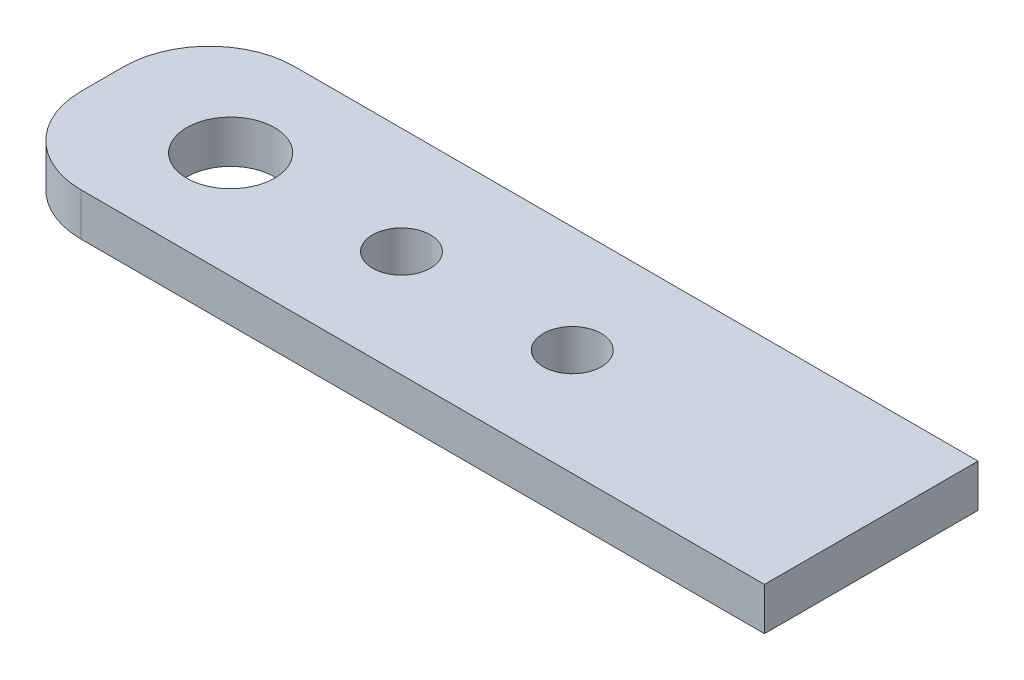
ISO-10303-21;
HEADER;
FILE_DESCRIPTION(('STEP AP214'),'2;1');
FILE_NAME('part.step','',(''),(''),'','','');
FILE_SCHEMA(('AUTOMOTIVE_DESIGN { 1 0 10303 214 1 1 1 1 }'));
ENDSEC;
DATA;
#1=APPLICATION_CONTEXT('core data for automotive mechanical design processes');
#2=APPLICATION_PROTOCOL_DEFINITION('international standard','automotive_design',2000,#1);
#3=PRODUCT_CONTEXT('',#1,'mechanical');
#4=PRODUCT('Part','Part','',(#3));
#5=PRODUCT_RELATED_PRODUCT_CATEGORY('part','',(#4));
#6=PRODUCT_DEFINITION_FORMATION('','',#4);
#7=PRODUCT_DEFINITION_CONTEXT('part definition',#1,'design');
#8=PRODUCT_DEFINITION('design','',#6,#7);
#9=PRODUCT_DEFINITION_SHAPE('','',#8);
#10=(LENGTH_UNIT() NAMED_UNIT(*) SI_UNIT(.MILLI.,.METRE.));
#11=(NAMED_UNIT(*) PLANE_ANGLE_UNIT() SI_UNIT($,.RADIAN.));
#12=(NAMED_UNIT(*) SI_UNIT($,.STERADIAN.) SOLID_ANGLE_UNIT());
#13=UNCERTAINTY_MEASURE_WITH_UNIT(LENGTH_MEASURE(1.E-05),#10,'distance_accuracy_value','');
#14=(GEOMETRIC_REPRESENTATION_CONTEXT(3) GLOBAL_UNCERTAINTY_ASSIGNED_CONTEXT((#13)) GLOBAL_UNIT_ASSIGNED_CONTEXT((#10,
#11,#12)) REPRESENTATION_CONTEXT('',''));
#15=CARTESIAN_POINT('',(0.,0.,0.));
#16=DIRECTION('',(0.,0.,1.));
#17=DIRECTION('',(1.,0.,0.));
#18=AXIS2_PLACEMENT_3D('',#15,#16,#17);
#19=CARTESIAN_POINT('',(28.575,3.175,7.9375));
#20=DIRECTION('',(-1.,0.,0.));
#21=DIRECTION('',(0.,0.,1.));
#22=AXIS2_PLACEMENT_3D('',#19,#20,#21);
#23=PLANE('',#22);
#24=DIRECTION('',(0.,0.,-1.));
#25=VECTOR('',#24,1.);
#26=CARTESIAN_POINT('',(28.575,0.,7.9375));
#27=LINE('',#26,#25);
#28=CARTESIAN_POINT('',(28.575,0.,7.9375));
#29=VERTEX_POINT('',#28);
#30=CARTESIAN_POINT('',(28.575,0.,-7.9375));
#31=VERTEX_POINT('',#30);
#32=EDGE_CURVE('E106',#29,#31,#27,.T.);
#33=ORIENTED_EDGE('',*,*,#32,.T.);
#34=DIRECTION('',(0.,-1.,0.));
#35=VECTOR('',#34,1.);
#36=CARTESIAN_POINT('',(28.575,3.175,-7.9375));
#37=LINE('',#36,#35);
#38=CARTESIAN_POINT('',(28.575,3.175,-7.9375));
#39=VERTEX_POINT('',#38);
#40=EDGE_CURVE('E91',#39,#31,#37,.T.);
#41=ORIENTED_EDGE('',*,*,#40,.F.);
#42=DIRECTION('',(0.,0.,-1.));
#43=VECTOR('',#42,1.);
#44=CARTESIAN_POINT('',(28.575,3.175,7.9375));
#45=LINE('',#44,#43);
#46=CARTESIAN_POINT('',(28.575,3.175,7.9375));
#47=VERTEX_POINT('',#46);
#48=EDGE_CURVE('E95',#47,#39,#45,.T.);
#49=ORIENTED_EDGE('',*,*,#48,.F.);
#50=DIRECTION('',(0.,-1.,0.));
#51=VECTOR('',#50,1.);
#52=CARTESIAN_POINT('',(28.575,3.175,7.9375));
#53=LINE('',#52,#51);
#54=EDGE_CURVE('E108',#47,#29,#53,.T.);
#55=ORIENTED_EDGE('',*,*,#54,.T.);
#56=EDGE_LOOP('',(#33,#41,#49,#55));
#57=FACE_BOUND('',#56,.T.);
#58=ADVANCED_FACE('F34',(#57),#23,.F.);
#59=CARTESIAN_POINT('',(-28.575,3.175,-7.9375));
#60=DIRECTION('',(0.,0.,1.));
#61=DIRECTION('',(1.,0.,0.));
#62=AXIS2_PLACEMENT_3D('',#59,#60,#61);
#63=PLANE('',#62);
#64=DIRECTION('',(-1.,0.,0.));
#65=VECTOR('',#64,1.);
#66=CARTESIAN_POINT('',(-28.575,0.,-7.9375));
#67=LINE('',#66,#65);
#68=CARTESIAN_POINT('',(-22.225,0.,-7.9375));
#69=VERTEX_POINT('',#68);
#70=EDGE_CURVE('E134',#31,#69,#67,.T.);
#71=ORIENTED_EDGE('',*,*,#70,.T.);
#72=DIRECTION('',(0.,-1.,0.));
#73=VECTOR('',#72,1.);
#74=CARTESIAN_POINT('',(-22.225,3.175,-7.9375));
#75=LINE('',#74,#73);
#76=CARTESIAN_POINT('',(-22.225,3.175,-7.9375));
#77=VERTEX_POINT('',#76);
#78=EDGE_CURVE('E57',#69,#77,#75,.F.);
#79=ORIENTED_EDGE('',*,*,#78,.T.);
#80=DIRECTION('',(-1.,0.,0.));
#81=VECTOR('',#80,1.);
#82=CARTESIAN_POINT('',(-28.575,3.175,-7.9375));
#83=LINE('',#82,#81);
#84=EDGE_CURVE('E87',#39,#77,#83,.T.);
#85=ORIENTED_EDGE('',*,*,#84,.F.);
#86=ORIENTED_EDGE('',*,*,#40,.T.);
#87=EDGE_LOOP('',(#71,#79,#85,#86));
#88=FACE_BOUND('',#87,.T.);
#89=ADVANCED_FACE('F89',(#88),#63,.F.);
#90=CARTESIAN_POINT('',(-28.575,3.175,7.9375));
#91=DIRECTION('',(1.,0.,0.));
#92=DIRECTION('',(0.,0.,-1.));
#93=AXIS2_PLACEMENT_3D('',#90,#91,#92);
#94=PLANE('',#93);
#95=DIRECTION('',(0.,0.,1.));
#96=VECTOR('',#95,1.);
#97=CARTESIAN_POINT('',(-28.575,3.175,7.9375));
#98=LINE('',#97,#96);
#99=CARTESIAN_POINT('',(-28.575,3.175,-1.5875));
#100=VERTEX_POINT('',#99);
#101=CARTESIAN_POINT('',(-28.575,3.175,1.5875));
#102=VERTEX_POINT('',#101);
#103=EDGE_CURVE('E94',#100,#102,#98,.T.);
#104=ORIENTED_EDGE('',*,*,#103,.F.);
#105=DIRECTION('',(0.,-1.,0.));
#106=VECTOR('',#105,1.);
#107=CARTESIAN_POINT('',(-28.575,3.175,-1.5875));
#108=LINE('',#107,#106);
#109=CARTESIAN_POINT('',(-28.575,0.,-1.5875));
#110=VERTEX_POINT('',#109);
#111=EDGE_CURVE('E110',#100,#110,#108,.T.);
#112=ORIENTED_EDGE('',*,*,#111,.T.);
#113=DIRECTION('',(0.,0.,1.));
#114=VECTOR('',#113,1.);
#115=CARTESIAN_POINT('',(-28.575,0.,7.9375));
#116=LINE('',#115,#114);
#117=CARTESIAN_POINT('',(-28.575,0.,1.5875));
#118=VERTEX_POINT('',#117);
#119=EDGE_CURVE('E135',#110,#118,#116,.T.);
#120=ORIENTED_EDGE('',*,*,#119,.T.);
#121=DIRECTION('',(0.,-1.,0.));
#122=VECTOR('',#121,1.);
#123=CARTESIAN_POINT('',(-28.575,3.175,1.5875));
#124=LINE('',#123,#122);
#125=EDGE_CURVE('E107',#118,#102,#124,.F.);
#126=ORIENTED_EDGE('',*,*,#125,.T.);
#127=EDGE_LOOP('',(#104,#112,#120,#126));
#128=FACE_BOUND('',#127,.T.);
#129=ADVANCED_FACE('F126',(#128),#94,.F.);
#130=CARTESIAN_POINT('',(-28.575,3.175,7.9375));
#131=DIRECTION('',(0.,0.,-1.));
#132=DIRECTION('',(-1.,0.,0.));
#133=AXIS2_PLACEMENT_3D('',#130,#131,#132);
#134=PLANE('',#133);
#135=DIRECTION('',(1.,0.,0.));
#136=VECTOR('',#135,1.);
#137=CARTESIAN_POINT('',(-28.575,3.175,7.9375));
#138=LINE('',#137,#136);
#139=CARTESIAN_POINT('',(-22.225,3.175,7.9375));
#140=VERTEX_POINT('',#139);
#141=EDGE_CURVE('E99',#140,#47,#138,.T.);
#142=ORIENTED_EDGE('',*,*,#141,.F.);
#143=DIRECTION('',(0.,-1.,0.));
#144=VECTOR('',#143,1.);
#145=CARTESIAN_POINT('',(-22.225,3.175,7.9375));
#146=LINE('',#145,#144);
#147=CARTESIAN_POINT('',(-22.225,0.,7.9375));
#148=VERTEX_POINT('',#147);
#149=EDGE_CURVE('E11',#140,#148,#146,.T.);
#150=ORIENTED_EDGE('',*,*,#149,.T.);
#151=DIRECTION('',(1.,0.,0.));
#152=VECTOR('',#151,1.);
#153=CARTESIAN_POINT('',(-28.575,0.,7.9375));
#154=LINE('',#153,#152);
#155=EDGE_CURVE('E103',#148,#29,#154,.T.);
#156=ORIENTED_EDGE('',*,*,#155,.T.);
#157=ORIENTED_EDGE('',*,*,#54,.F.);
#158=EDGE_LOOP('',(#142,#150,#156,#157));
#159=FACE_BOUND('',#158,.T.);
#160=ADVANCED_FACE('F143',(#159),#134,.F.);
#161=CARTESIAN_POINT('',(0.,3.175,0.));
#162=DIRECTION('',(0.,-1.,0.));
#163=DIRECTION('',(0.,0.,-1.));
#164=AXIS2_PLACEMENT_3D('',#161,#162,#163);
#165=PLANE('',#164);
#166=CARTESIAN_POINT('',(-6.35,3.175,0.));
#167=DIRECTION('',(0.,1.,0.));
#168=DIRECTION('',(0.,0.,1.));
#169=AXIS2_PLACEMENT_3D('',#166,#167,#168);
#170=CIRCLE('',#169,2.15265);
#171=CARTESIAN_POINT('',(-6.35,3.175,2.15265));
#172=VERTEX_POINT('',#171);
#173=EDGE_CURVE('E186',#172,#172,#170,.T.);
#174=ORIENTED_EDGE('',*,*,#173,.F.);
#175=EDGE_LOOP('',(#174));
#176=FACE_BOUND('',#175,.T.);
#177=CARTESIAN_POINT('',(6.35,3.175,0.));
#178=DIRECTION('',(0.,1.,0.));
#179=DIRECTION('',(0.,0.,1.));
#180=AXIS2_PLACEMENT_3D('',#177,#178,#179);
#181=CIRCLE('',#180,2.15265);
#182=CARTESIAN_POINT('',(6.35,3.175,2.15265));
#183=VERTEX_POINT('',#182);
#184=EDGE_CURVE('E188',#183,#183,#181,.T.);
#185=ORIENTED_EDGE('',*,*,#184,.F.);
#186=EDGE_LOOP('',(#185));
#187=FACE_BOUND('',#186,.T.);
#188=CARTESIAN_POINT('',(-19.05,3.175,0.));
#189=DIRECTION('',(0.,1.,0.));
#190=DIRECTION('',(0.,0.,1.));
#191=AXIS2_PLACEMENT_3D('',#188,#189,#190);
#192=CIRCLE('',#191,3.26389999999999);
#193=CARTESIAN_POINT('',(-19.05,3.175,3.26389999999999));
#194=VERTEX_POINT('',#193);
#195=EDGE_CURVE('E196',#194,#194,#192,.T.);
#196=ORIENTED_EDGE('',*,*,#195,.F.);
#197=EDGE_LOOP('',(#196));
#198=FACE_BOUND('',#197,.T.);
#199=ORIENTED_EDGE('',*,*,#84,.T.);
#200=CARTESIAN_POINT('',(-22.225,3.175,-1.5875));
#201=DIRECTION('',(0.,-1.,0.));
#202=DIRECTION('',(0.,0.,-1.));
#203=AXIS2_PLACEMENT_3D('',#200,#201,#202);
#204=CIRCLE('',#203,6.35);
#205=EDGE_CURVE('E42',#77,#100,#204,.F.);
#206=ORIENTED_EDGE('',*,*,#205,.T.);
#207=ORIENTED_EDGE('',*,*,#103,.T.);
#208=CARTESIAN_POINT('',(-22.225,3.175,1.5875));
#209=DIRECTION('',(0.,-1.,0.));
#210=DIRECTION('',(0.,0.,-1.));
#211=AXIS2_PLACEMENT_3D('',#208,#209,#210);
#212=CIRCLE('',#211,6.35);
#213=EDGE_CURVE('E49',#102,#140,#212,.F.);
#214=ORIENTED_EDGE('',*,*,#213,.T.);
#215=ORIENTED_EDGE('',*,*,#141,.T.);
#216=ORIENTED_EDGE('',*,*,#48,.T.);
#217=EDGE_LOOP('',(#199,#206,#207,#214,#215,#216));
#218=FACE_BOUND('',#217,.T.);
#219=ADVANCED_FACE('F98',(#176,#187,#198,#218),#165,.F.);
#220=CARTESIAN_POINT('',(0.,0.,0.));
#221=DIRECTION('',(0.,-1.,0.));
#222=DIRECTION('',(0.,0.,-1.));
#223=AXIS2_PLACEMENT_3D('',#220,#221,#222);
#224=PLANE('',#223);
#225=CARTESIAN_POINT('',(-6.35,0.,0.));
#226=DIRECTION('',(0.,1.,0.));
#227=DIRECTION('',(0.,0.,1.));
#228=AXIS2_PLACEMENT_3D('',#225,#226,#227);
#229=CIRCLE('',#228,2.15265);
#230=CARTESIAN_POINT('',(-6.35,0.,2.15265));
#231=VERTEX_POINT('',#230);
#232=EDGE_CURVE('E183',#231,#231,#229,.T.);
#233=ORIENTED_EDGE('',*,*,#232,.T.);
#234=EDGE_LOOP('',(#233));
#235=FACE_BOUND('',#234,.T.);
#236=CARTESIAN_POINT('',(6.35,0.,0.));
#237=DIRECTION('',(0.,1.,0.));
#238=DIRECTION('',(0.,0.,1.));
#239=AXIS2_PLACEMENT_3D('',#236,#237,#238);
#240=CIRCLE('',#239,2.15265);
#241=CARTESIAN_POINT('',(6.35,0.,2.15265));
#242=VERTEX_POINT('',#241);
#243=EDGE_CURVE('E193',#242,#242,#240,.T.);
#244=ORIENTED_EDGE('',*,*,#243,.T.);
#245=EDGE_LOOP('',(#244));
#246=FACE_BOUND('',#245,.T.);
#247=CARTESIAN_POINT('',(-19.05,0.,0.));
#248=DIRECTION('',(0.,1.,0.));
#249=DIRECTION('',(0.,0.,1.));
#250=AXIS2_PLACEMENT_3D('',#247,#248,#249);
#251=CIRCLE('',#250,3.2639);
#252=CARTESIAN_POINT('',(-19.05,0.,3.2639));
#253=VERTEX_POINT('',#252);
#254=EDGE_CURVE('E138',#253,#253,#251,.T.);
#255=ORIENTED_EDGE('',*,*,#254,.T.);
#256=EDGE_LOOP('',(#255));
#257=FACE_BOUND('',#256,.T.);
#258=ORIENTED_EDGE('',*,*,#119,.F.);
#259=CARTESIAN_POINT('',(-22.225,0.,-1.5875));
#260=DIRECTION('',(0.,-1.,0.));
#261=DIRECTION('',(0.,0.,-1.));
#262=AXIS2_PLACEMENT_3D('',#259,#260,#261);
#263=CIRCLE('',#262,6.35);
#264=EDGE_CURVE('E119',#110,#69,#263,.T.);
#265=ORIENTED_EDGE('',*,*,#264,.T.);
#266=ORIENTED_EDGE('',*,*,#70,.F.);
#267=ORIENTED_EDGE('',*,*,#32,.F.);
#268=ORIENTED_EDGE('',*,*,#155,.F.);
#269=CARTESIAN_POINT('',(-22.225,0.,1.5875));
#270=DIRECTION('',(0.,-1.,0.));
#271=DIRECTION('',(0.,0.,-1.));
#272=AXIS2_PLACEMENT_3D('',#269,#270,#271);
#273=CIRCLE('',#272,6.35);
#274=EDGE_CURVE('E117',#148,#118,#273,.T.);
#275=ORIENTED_EDGE('',*,*,#274,.T.);
#276=EDGE_LOOP('',(#258,#265,#266,#267,#268,#275));
#277=FACE_BOUND('',#276,.T.);
#278=ADVANCED_FACE('F133',(#235,#246,#257,#277),#224,.T.);
#279=CARTESIAN_POINT('',(-19.05,3.175,0.));
#280=DIRECTION('',(0.,1.,0.));
#281=DIRECTION('',(0.,0.,1.));
#282=AXIS2_PLACEMENT_3D('',#279,#280,#281);
#283=CYLINDRICAL_SURFACE('',#282,3.26389999999999);
#284=ORIENTED_EDGE('',*,*,#254,.F.);
#285=EDGE_LOOP('',(#284));
#286=FACE_BOUND('',#285,.T.);
#287=ORIENTED_EDGE('',*,*,#195,.T.);
#288=EDGE_LOOP('',(#287));
#289=FACE_BOUND('',#288,.T.);
#290=ADVANCED_FACE('F155',(#286,#289),#283,.F.);
#291=CARTESIAN_POINT('',(-22.225,3.175,-1.5875));
#292=DIRECTION('',(0.,-1.,0.));
#293=DIRECTION('',(0.,0.,-1.));
#294=AXIS2_PLACEMENT_3D('',#291,#292,#293);
#295=CYLINDRICAL_SURFACE('',#294,6.35);
#296=ORIENTED_EDGE('',*,*,#205,.F.);
#297=ORIENTED_EDGE('',*,*,#78,.F.);
#298=ORIENTED_EDGE('',*,*,#264,.F.);
#299=ORIENTED_EDGE('',*,*,#111,.F.);
#300=EDGE_LOOP('',(#296,#297,#298,#299));
#301=FACE_BOUND('',#300,.T.);
#302=ADVANCED_FACE('F131',(#301),#295,.T.);
#303=CARTESIAN_POINT('',(-22.225,3.175,1.5875));
#304=DIRECTION('',(0.,-1.,0.));
#305=DIRECTION('',(0.,0.,-1.));
#306=AXIS2_PLACEMENT_3D('',#303,#304,#305);
#307=CYLINDRICAL_SURFACE('',#306,6.35);
#308=ORIENTED_EDGE('',*,*,#213,.F.);
#309=ORIENTED_EDGE('',*,*,#125,.F.);
#310=ORIENTED_EDGE('',*,*,#274,.F.);
#311=ORIENTED_EDGE('',*,*,#149,.F.);
#312=EDGE_LOOP('',(#308,#309,#310,#311));
#313=FACE_BOUND('',#312,.T.);
#314=ADVANCED_FACE('F36',(#313),#307,.T.);
#315=CARTESIAN_POINT('',(6.35,3.175,0.));
#316=DIRECTION('',(0.,1.,0.));
#317=DIRECTION('',(0.,0.,1.));
#318=AXIS2_PLACEMENT_3D('',#315,#316,#317);
#319=CYLINDRICAL_SURFACE('',#318,2.15265);
#320=ORIENTED_EDGE('',*,*,#243,.F.);
#321=EDGE_LOOP('',(#320));
#322=FACE_BOUND('',#321,.T.);
#323=ORIENTED_EDGE('',*,*,#184,.T.);
#324=EDGE_LOOP('',(#323));
#325=FACE_BOUND('',#324,.T.);
#326=ADVANCED_FACE('F147',(#322,#325),#319,.F.);
#327=CARTESIAN_POINT('',(-6.35,3.175,0.));
#328=DIRECTION('',(0.,1.,0.));
#329=DIRECTION('',(0.,0.,1.));
#330=AXIS2_PLACEMENT_3D('',#327,#328,#329);
#331=CYLINDRICAL_SURFACE('',#330,2.15265);
#332=ORIENTED_EDGE('',*,*,#232,.F.);
#333=EDGE_LOOP('',(#332));
#334=FACE_BOUND('',#333,.T.);
#335=ORIENTED_EDGE('',*,*,#173,.T.);
#336=EDGE_LOOP('',(#335));
#337=FACE_BOUND('',#336,.T.);
#338=ADVANCED_FACE('F152',(#334,#337),#331,.F.);
#339=CLOSED_SHELL('',(#58,#89,#129,#160,#219,#278,#290,#302,#314,#326,#338));
#340=MANIFOLD_SOLID_BREP('B2',#339);
#341=ADVANCED_BREP_SHAPE_REPRESENTATION('',(#18,#340),#14);
#342=SHAPE_DEFINITION_REPRESENTATION(#9,#341);
ENDSEC;
END-ISO-10303-21;
